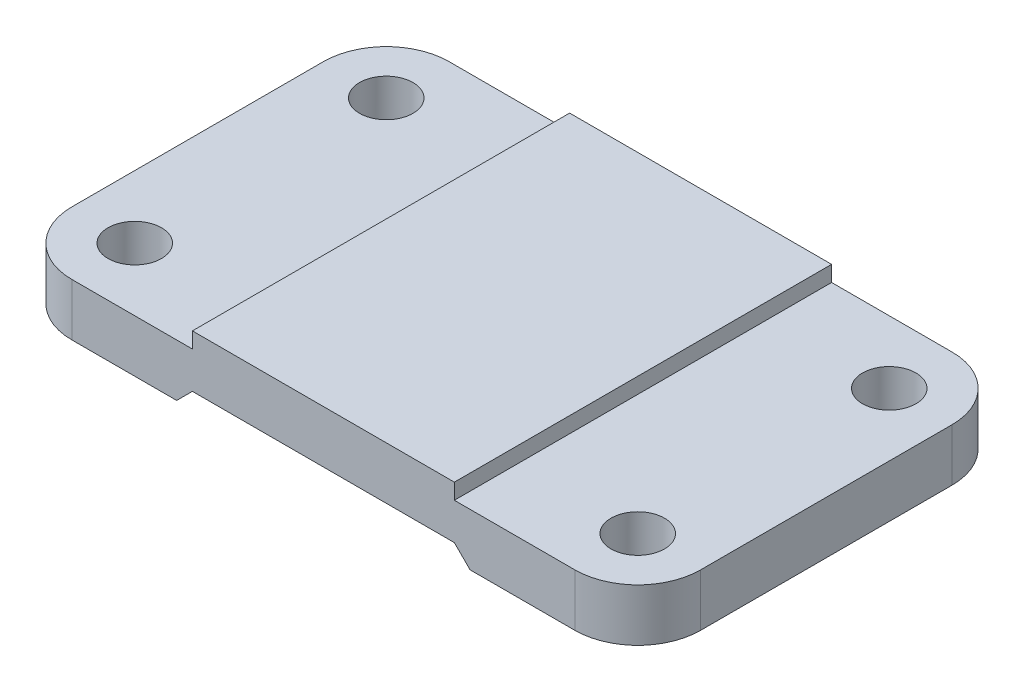
ISO-10303-21;
HEADER;
FILE_DESCRIPTION(('STEP AP214'),'2;1');
FILE_NAME('part.step','',(''),(''),'','','');
FILE_SCHEMA(('AUTOMOTIVE_DESIGN { 1 0 10303 214 1 1 1 1 }'));
ENDSEC;
DATA;
#1=APPLICATION_CONTEXT('core data for automotive mechanical design processes');
#2=APPLICATION_PROTOCOL_DEFINITION('international standard','automotive_design',2000,#1);
#3=PRODUCT_CONTEXT('',#1,'mechanical');
#4=PRODUCT('Part','Part','',(#3));
#5=PRODUCT_RELATED_PRODUCT_CATEGORY('part','',(#4));
#6=PRODUCT_DEFINITION_FORMATION('','',#4);
#7=PRODUCT_DEFINITION_CONTEXT('part definition',#1,'design');
#8=PRODUCT_DEFINITION('design','',#6,#7);
#9=PRODUCT_DEFINITION_SHAPE('','',#8);
#10=(LENGTH_UNIT() NAMED_UNIT(*) SI_UNIT(.MILLI.,.METRE.));
#11=(NAMED_UNIT(*) PLANE_ANGLE_UNIT() SI_UNIT($,.RADIAN.));
#12=(NAMED_UNIT(*) SI_UNIT($,.STERADIAN.) SOLID_ANGLE_UNIT());
#13=UNCERTAINTY_MEASURE_WITH_UNIT(LENGTH_MEASURE(1.E-05),#10,'distance_accuracy_value','');
#14=(GEOMETRIC_REPRESENTATION_CONTEXT(3) GLOBAL_UNCERTAINTY_ASSIGNED_CONTEXT((#13)) GLOBAL_UNIT_ASSIGNED_CONTEXT((#10,
#11,#12)) REPRESENTATION_CONTEXT('',''));
#15=CARTESIAN_POINT('',(0.,0.,0.));
#16=DIRECTION('',(0.,0.,1.));
#17=DIRECTION('',(1.,0.,0.));
#18=AXIS2_PLACEMENT_3D('',#15,#16,#17);
#19=CARTESIAN_POINT('',(0.,0.,0.));
#20=DIRECTION('',(0.,-1.,0.));
#21=DIRECTION('',(0.,0.,-1.));
#22=AXIS2_PLACEMENT_3D('',#19,#20,#21);
#23=PLANE('',#22);
#24=DIRECTION('',(0.,0.,1.));
#25=VECTOR('',#24,1.);
#26=CARTESIAN_POINT('',(-28.,0.,-36.));
#27=LINE('',#26,#25);
#28=CARTESIAN_POINT('',(-28.,0.,-36.));
#29=VERTEX_POINT('',#28);
#30=CARTESIAN_POINT('',(-28.,0.,36.));
#31=VERTEX_POINT('',#30);
#32=EDGE_CURVE('E179',#29,#31,#27,.T.);
#33=ORIENTED_EDGE('',*,*,#32,.T.);
#34=DIRECTION('',(1.,0.,0.));
#35=VECTOR('',#34,1.);
#36=CARTESIAN_POINT('',(-60.,0.,36.));
#37=LINE('',#36,#35);
#38=CARTESIAN_POINT('',(-48.,0.,36.));
#39=VERTEX_POINT('',#38);
#40=EDGE_CURVE('E238',#39,#31,#37,.T.);
#41=ORIENTED_EDGE('',*,*,#40,.F.);
#42=CARTESIAN_POINT('',(-48.,0.,24.));
#43=DIRECTION('',(0.,-1.,0.));
#44=DIRECTION('',(0.,0.,-1.));
#45=AXIS2_PLACEMENT_3D('',#42,#43,#44);
#46=CIRCLE('',#45,12.);
#47=CARTESIAN_POINT('',(-60.,0.,24.));
#48=VERTEX_POINT('',#47);
#49=EDGE_CURVE('E267',#39,#48,#46,.T.);
#50=ORIENTED_EDGE('',*,*,#49,.T.);
#51=DIRECTION('',(0.,0.,1.));
#52=VECTOR('',#51,1.);
#53=CARTESIAN_POINT('',(-60.,0.,36.));
#54=LINE('',#53,#52);
#55=CARTESIAN_POINT('',(-60.,0.,-24.));
#56=VERTEX_POINT('',#55);
#57=EDGE_CURVE('E252',#56,#48,#54,.T.);
#58=ORIENTED_EDGE('',*,*,#57,.F.);
#59=CARTESIAN_POINT('',(-48.,0.,-24.));
#60=DIRECTION('',(0.,-1.,0.));
#61=DIRECTION('',(0.,0.,-1.));
#62=AXIS2_PLACEMENT_3D('',#59,#60,#61);
#63=CIRCLE('',#62,12.);
#64=CARTESIAN_POINT('',(-48.,0.,-36.));
#65=VERTEX_POINT('',#64);
#66=EDGE_CURVE('E269',#56,#65,#63,.T.);
#67=ORIENTED_EDGE('',*,*,#66,.T.);
#68=DIRECTION('',(-1.,0.,0.));
#69=VECTOR('',#68,1.);
#70=CARTESIAN_POINT('',(-60.,0.,-36.));
#71=LINE('',#70,#69);
#72=EDGE_CURVE('E250',#29,#65,#71,.T.);
#73=ORIENTED_EDGE('',*,*,#72,.F.);
#74=EDGE_LOOP('',(#33,#41,#50,#58,#67,#73));
#75=FACE_BOUND('',#74,.T.);
#76=CARTESIAN_POINT('',(-48.,0.,24.));
#77=DIRECTION('',(0.,-1.,0.));
#78=DIRECTION('',(0.,0.,-1.));
#79=AXIS2_PLACEMENT_3D('',#76,#77,#78);
#80=CIRCLE('',#79,5.09999999999999);
#81=CARTESIAN_POINT('',(-48.,0.,18.9));
#82=VERTEX_POINT('',#81);
#83=EDGE_CURVE('E230',#82,#82,#80,.T.);
#84=ORIENTED_EDGE('',*,*,#83,.F.);
#85=EDGE_LOOP('',(#84));
#86=FACE_BOUND('',#85,.T.);
#87=CARTESIAN_POINT('',(-48.,0.,-24.));
#88=DIRECTION('',(0.,-1.,0.));
#89=DIRECTION('',(0.,0.,-1.));
#90=AXIS2_PLACEMENT_3D('',#87,#88,#89);
#91=CIRCLE('',#90,5.09999999999999);
#92=CARTESIAN_POINT('',(-48.,0.,-29.1));
#93=VERTEX_POINT('',#92);
#94=EDGE_CURVE('E224',#93,#93,#91,.T.);
#95=ORIENTED_EDGE('',*,*,#94,.F.);
#96=EDGE_LOOP('',(#95));
#97=FACE_BOUND('',#96,.T.);
#98=ADVANCED_FACE('F37',(#75,#86,#97),#23,.T.);
#99=CARTESIAN_POINT('',(0.,10.,0.));
#100=DIRECTION('',(0.,-1.,0.));
#101=DIRECTION('',(0.,0.,-1.));
#102=AXIS2_PLACEMENT_3D('',#99,#100,#101);
#103=PLANE('',#102);
#104=CARTESIAN_POINT('',(-48.,10.,-24.));
#105=DIRECTION('',(0.,1.,0.));
#106=DIRECTION('',(0.,0.,1.));
#107=AXIS2_PLACEMENT_3D('',#104,#105,#106);
#108=CIRCLE('',#107,5.09999999999999);
#109=CARTESIAN_POINT('',(-48.,10.,-18.9));
#110=VERTEX_POINT('',#109);
#111=EDGE_CURVE('E221',#110,#110,#108,.T.);
#112=ORIENTED_EDGE('',*,*,#111,.F.);
#113=EDGE_LOOP('',(#112));
#114=FACE_BOUND('',#113,.T.);
#115=CARTESIAN_POINT('',(-48.,10.,24.));
#116=DIRECTION('',(0.,1.,0.));
#117=DIRECTION('',(0.,0.,1.));
#118=AXIS2_PLACEMENT_3D('',#115,#116,#117);
#119=CIRCLE('',#118,5.09999999999999);
#120=CARTESIAN_POINT('',(-48.,10.,29.1));
#121=VERTEX_POINT('',#120);
#122=EDGE_CURVE('E227',#121,#121,#119,.T.);
#123=ORIENTED_EDGE('',*,*,#122,.F.);
#124=EDGE_LOOP('',(#123));
#125=FACE_BOUND('',#124,.T.);
#126=DIRECTION('',(0.,0.,1.));
#127=VECTOR('',#126,1.);
#128=CARTESIAN_POINT('',(-25.,10.,36.));
#129=LINE('',#128,#127);
#130=CARTESIAN_POINT('',(-25.,10.,-36.));
#131=VERTEX_POINT('',#130);
#132=CARTESIAN_POINT('',(-25.,10.,36.));
#133=VERTEX_POINT('',#132);
#134=EDGE_CURVE('E182',#131,#133,#129,.T.);
#135=ORIENTED_EDGE('',*,*,#134,.F.);
#136=DIRECTION('',(-1.,0.,0.));
#137=VECTOR('',#136,1.);
#138=CARTESIAN_POINT('',(-60.,10.,-36.));
#139=LINE('',#138,#137);
#140=CARTESIAN_POINT('',(-48.,10.,-36.));
#141=VERTEX_POINT('',#140);
#142=EDGE_CURVE('E237',#131,#141,#139,.T.);
#143=ORIENTED_EDGE('',*,*,#142,.T.);
#144=CARTESIAN_POINT('',(-48.,10.,-24.));
#145=DIRECTION('',(0.,-1.,0.));
#146=DIRECTION('',(0.,0.,-1.));
#147=AXIS2_PLACEMENT_3D('',#144,#145,#146);
#148=CIRCLE('',#147,12.);
#149=CARTESIAN_POINT('',(-60.,10.,-24.));
#150=VERTEX_POINT('',#149);
#151=EDGE_CURVE('E283',#141,#150,#148,.F.);
#152=ORIENTED_EDGE('',*,*,#151,.T.);
#153=DIRECTION('',(0.,0.,1.));
#154=VECTOR('',#153,1.);
#155=CARTESIAN_POINT('',(-60.,10.,36.));
#156=LINE('',#155,#154);
#157=CARTESIAN_POINT('',(-60.,10.,24.));
#158=VERTEX_POINT('',#157);
#159=EDGE_CURVE('E241',#150,#158,#156,.T.);
#160=ORIENTED_EDGE('',*,*,#159,.T.);
#161=CARTESIAN_POINT('',(-48.,10.,24.));
#162=DIRECTION('',(0.,-1.,0.));
#163=DIRECTION('',(0.,0.,-1.));
#164=AXIS2_PLACEMENT_3D('',#161,#162,#163);
#165=CIRCLE('',#164,12.);
#166=CARTESIAN_POINT('',(-48.,10.,36.));
#167=VERTEX_POINT('',#166);
#168=EDGE_CURVE('E281',#158,#167,#165,.F.);
#169=ORIENTED_EDGE('',*,*,#168,.T.);
#170=DIRECTION('',(1.,0.,0.));
#171=VECTOR('',#170,1.);
#172=CARTESIAN_POINT('',(-60.,10.,36.));
#173=LINE('',#172,#171);
#174=EDGE_CURVE('E245',#167,#133,#173,.T.);
#175=ORIENTED_EDGE('',*,*,#174,.T.);
#176=EDGE_LOOP('',(#135,#143,#152,#160,#169,#175));
#177=FACE_BOUND('',#176,.T.);
#178=ADVANCED_FACE('F329',(#114,#125,#177),#103,.F.);
#179=CARTESIAN_POINT('',(48.,10.,24.));
#180=DIRECTION('',(0.,1.,0.));
#181=DIRECTION('',(0.,0.,1.));
#182=AXIS2_PLACEMENT_3D('',#179,#180,#181);
#183=CIRCLE('',#182,5.09999999999999);
#184=CARTESIAN_POINT('',(48.,10.,29.1));
#185=VERTEX_POINT('',#184);
#186=EDGE_CURVE('E209',#185,#185,#183,.T.);
#187=ORIENTED_EDGE('',*,*,#186,.F.);
#188=EDGE_LOOP('',(#187));
#189=FACE_BOUND('',#188,.T.);
#190=CARTESIAN_POINT('',(48.,10.,-24.));
#191=DIRECTION('',(0.,1.,0.));
#192=DIRECTION('',(0.,0.,1.));
#193=AXIS2_PLACEMENT_3D('',#190,#191,#192);
#194=CIRCLE('',#193,5.09999999999999);
#195=CARTESIAN_POINT('',(48.,10.,-18.9));
#196=VERTEX_POINT('',#195);
#197=EDGE_CURVE('E215',#196,#196,#194,.T.);
#198=ORIENTED_EDGE('',*,*,#197,.F.);
#199=EDGE_LOOP('',(#198));
#200=FACE_BOUND('',#199,.T.);
#201=DIRECTION('',(0.,0.,-1.));
#202=VECTOR('',#201,1.);
#203=CARTESIAN_POINT('',(25.,10.,36.));
#204=LINE('',#203,#202);
#205=CARTESIAN_POINT('',(25.,10.,36.));
#206=VERTEX_POINT('',#205);
#207=CARTESIAN_POINT('',(25.,10.,-36.));
#208=VERTEX_POINT('',#207);
#209=EDGE_CURVE('E60',#206,#208,#204,.T.);
#210=ORIENTED_EDGE('',*,*,#209,.F.);
#211=CARTESIAN_POINT('',(48.,10.,36.));
#212=VERTEX_POINT('',#211);
#213=EDGE_CURVE('E244',#206,#212,#173,.T.);
#214=ORIENTED_EDGE('',*,*,#213,.T.);
#215=CARTESIAN_POINT('',(48.,10.,24.));
#216=DIRECTION('',(0.,-1.,0.));
#217=DIRECTION('',(0.,0.,-1.));
#218=AXIS2_PLACEMENT_3D('',#215,#216,#217);
#219=CIRCLE('',#218,12.);
#220=CARTESIAN_POINT('',(60.,10.,24.));
#221=VERTEX_POINT('',#220);
#222=EDGE_CURVE('E277',#212,#221,#219,.F.);
#223=ORIENTED_EDGE('',*,*,#222,.T.);
#224=DIRECTION('',(0.,0.,-1.));
#225=VECTOR('',#224,1.);
#226=CARTESIAN_POINT('',(60.,10.,36.));
#227=LINE('',#226,#225);
#228=CARTESIAN_POINT('',(60.,10.,-24.));
#229=VERTEX_POINT('',#228);
#230=EDGE_CURVE('E234',#221,#229,#227,.T.);
#231=ORIENTED_EDGE('',*,*,#230,.T.);
#232=CARTESIAN_POINT('',(48.,10.,-24.));
#233=DIRECTION('',(0.,-1.,0.));
#234=DIRECTION('',(0.,0.,-1.));
#235=AXIS2_PLACEMENT_3D('',#232,#233,#234);
#236=CIRCLE('',#235,12.);
#237=CARTESIAN_POINT('',(48.,10.,-36.));
#238=VERTEX_POINT('',#237);
#239=EDGE_CURVE('E279',#229,#238,#236,.F.);
#240=ORIENTED_EDGE('',*,*,#239,.T.);
#241=EDGE_CURVE('E239',#238,#208,#139,.T.);
#242=ORIENTED_EDGE('',*,*,#241,.T.);
#243=EDGE_LOOP('',(#210,#214,#223,#231,#240,#242));
#244=FACE_BOUND('',#243,.T.);
#245=ADVANCED_FACE('F311',(#189,#200,#244),#103,.F.);
#246=CARTESIAN_POINT('',(60.,10.,36.));
#247=DIRECTION('',(-1.,0.,0.));
#248=DIRECTION('',(0.,0.,1.));
#249=AXIS2_PLACEMENT_3D('',#246,#247,#248);
#250=PLANE('',#249);
#251=DIRECTION('',(0.,0.,-1.));
#252=VECTOR('',#251,1.);
#253=CARTESIAN_POINT('',(60.,0.,36.));
#254=LINE('',#253,#252);
#255=CARTESIAN_POINT('',(60.,0.,24.));
#256=VERTEX_POINT('',#255);
#257=CARTESIAN_POINT('',(60.,0.,-24.));
#258=VERTEX_POINT('',#257);
#259=EDGE_CURVE('E233',#256,#258,#254,.T.);
#260=ORIENTED_EDGE('',*,*,#259,.T.);
#261=DIRECTION('',(0.,-1.,0.));
#262=VECTOR('',#261,1.);
#263=CARTESIAN_POINT('',(60.,10.,-24.));
#264=LINE('',#263,#262);
#265=EDGE_CURVE('E11',#258,#229,#264,.F.);
#266=ORIENTED_EDGE('',*,*,#265,.T.);
#267=ORIENTED_EDGE('',*,*,#230,.F.);
#268=DIRECTION('',(0.,-1.,0.));
#269=VECTOR('',#268,1.);
#270=CARTESIAN_POINT('',(60.,10.,24.));
#271=LINE('',#270,#269);
#272=EDGE_CURVE('E45',#221,#256,#271,.T.);
#273=ORIENTED_EDGE('',*,*,#272,.T.);
#274=EDGE_LOOP('',(#260,#266,#267,#273));
#275=FACE_BOUND('',#274,.T.);
#276=ADVANCED_FACE('F295',(#275),#250,.F.);
#277=CARTESIAN_POINT('',(-60.,10.,-36.));
#278=DIRECTION('',(0.,0.,1.));
#279=DIRECTION('',(1.,0.,0.));
#280=AXIS2_PLACEMENT_3D('',#277,#278,#279);
#281=PLANE('',#280);
#282=DIRECTION('',(-1.,0.,0.));
#283=VECTOR('',#282,1.);
#284=CARTESIAN_POINT('',(-25.,2.99999999999999,-36.));
#285=LINE('',#284,#283);
#286=CARTESIAN_POINT('',(25.,2.99999999999999,-36.));
#287=VERTEX_POINT('',#286);
#288=CARTESIAN_POINT('',(-25.,2.99999999999999,-36.));
#289=VERTEX_POINT('',#288);
#290=EDGE_CURVE('E159',#287,#289,#285,.T.);
#291=ORIENTED_EDGE('',*,*,#290,.T.);
#292=DIRECTION('',(-0.707106781186551,-0.707106781186544,0.));
#293=VECTOR('',#292,1.);
#294=CARTESIAN_POINT('',(-28.,0.,-36.));
#295=LINE('',#294,#293);
#296=EDGE_CURVE('E164',#289,#29,#295,.T.);
#297=ORIENTED_EDGE('',*,*,#296,.T.);
#298=ORIENTED_EDGE('',*,*,#72,.T.);
#299=DIRECTION('',(0.,-1.,0.));
#300=VECTOR('',#299,1.);
#301=CARTESIAN_POINT('',(-48.,10.,-36.));
#302=LINE('',#301,#300);
#303=EDGE_CURVE('E274',#65,#141,#302,.F.);
#304=ORIENTED_EDGE('',*,*,#303,.T.);
#305=ORIENTED_EDGE('',*,*,#142,.F.);
#306=DIRECTION('',(0.,-1.,0.));
#307=VECTOR('',#306,1.);
#308=CARTESIAN_POINT('',(-25.,13.,-36.));
#309=LINE('',#308,#307);
#310=CARTESIAN_POINT('',(-25.,13.,-36.));
#311=VERTEX_POINT('',#310);
#312=EDGE_CURVE('E194',#311,#131,#309,.T.);
#313=ORIENTED_EDGE('',*,*,#312,.F.);
#314=DIRECTION('',(-1.,0.,0.));
#315=VECTOR('',#314,1.);
#316=CARTESIAN_POINT('',(25.,13.,-36.));
#317=LINE('',#316,#315);
#318=CARTESIAN_POINT('',(25.,13.,-36.));
#319=VERTEX_POINT('',#318);
#320=EDGE_CURVE('E192',#319,#311,#317,.T.);
#321=ORIENTED_EDGE('',*,*,#320,.F.);
#322=DIRECTION('',(0.,-1.,0.));
#323=VECTOR('',#322,1.);
#324=CARTESIAN_POINT('',(25.,13.,-36.));
#325=LINE('',#324,#323);
#326=EDGE_CURVE('E200',#319,#208,#325,.T.);
#327=ORIENTED_EDGE('',*,*,#326,.T.);
#328=ORIENTED_EDGE('',*,*,#241,.F.);
#329=DIRECTION('',(0.,-1.,0.));
#330=VECTOR('',#329,1.);
#331=CARTESIAN_POINT('',(48.,10.,-36.));
#332=LINE('',#331,#330);
#333=CARTESIAN_POINT('',(48.,0.,-36.));
#334=VERTEX_POINT('',#333);
#335=EDGE_CURVE('E272',#238,#334,#332,.T.);
#336=ORIENTED_EDGE('',*,*,#335,.T.);
#337=CARTESIAN_POINT('',(28.,0.,-36.));
#338=VERTEX_POINT('',#337);
#339=EDGE_CURVE('E170',#334,#338,#71,.T.);
#340=ORIENTED_EDGE('',*,*,#339,.T.);
#341=DIRECTION('',(-0.707106781186544,0.707106781186551,0.));
#342=VECTOR('',#341,1.);
#343=CARTESIAN_POINT('',(25.,2.99999999999999,-36.));
#344=LINE('',#343,#342);
#345=EDGE_CURVE('E52',#338,#287,#344,.T.);
#346=ORIENTED_EDGE('',*,*,#345,.T.);
#347=EDGE_LOOP('',(#291,#297,#298,#304,#305,#313,#321,#327,#328,#336,#340,#346));
#348=FACE_BOUND('',#347,.T.);
#349=ADVANCED_FACE('F167',(#348),#281,.F.);
#350=CARTESIAN_POINT('',(-60.,10.,36.));
#351=DIRECTION('',(1.,0.,0.));
#352=DIRECTION('',(0.,0.,-1.));
#353=AXIS2_PLACEMENT_3D('',#350,#351,#352);
#354=PLANE('',#353);
#355=ORIENTED_EDGE('',*,*,#159,.F.);
#356=DIRECTION('',(0.,-1.,0.));
#357=VECTOR('',#356,1.);
#358=CARTESIAN_POINT('',(-60.,10.,-24.));
#359=LINE('',#358,#357);
#360=EDGE_CURVE('E259',#150,#56,#359,.T.);
#361=ORIENTED_EDGE('',*,*,#360,.T.);
#362=ORIENTED_EDGE('',*,*,#57,.T.);
#363=DIRECTION('',(0.,-1.,0.));
#364=VECTOR('',#363,1.);
#365=CARTESIAN_POINT('',(-60.,10.,24.));
#366=LINE('',#365,#364);
#367=EDGE_CURVE('E247',#48,#158,#366,.F.);
#368=ORIENTED_EDGE('',*,*,#367,.T.);
#369=EDGE_LOOP('',(#355,#361,#362,#368));
#370=FACE_BOUND('',#369,.T.);
#371=ADVANCED_FACE('F347',(#370),#354,.F.);
#372=CARTESIAN_POINT('',(-60.,10.,36.));
#373=DIRECTION('',(0.,0.,-1.));
#374=DIRECTION('',(-1.,0.,0.));
#375=AXIS2_PLACEMENT_3D('',#372,#373,#374);
#376=PLANE('',#375);
#377=ORIENTED_EDGE('',*,*,#40,.T.);
#378=DIRECTION('',(-0.707106781186551,-0.707106781186544,0.));
#379=VECTOR('',#378,1.);
#380=CARTESIAN_POINT('',(-28.,0.,36.));
#381=LINE('',#380,#379);
#382=CARTESIAN_POINT('',(-25.,2.99999999999999,36.));
#383=VERTEX_POINT('',#382);
#384=EDGE_CURVE('E171',#383,#31,#381,.T.);
#385=ORIENTED_EDGE('',*,*,#384,.F.);
#386=DIRECTION('',(-1.,0.,0.));
#387=VECTOR('',#386,1.);
#388=CARTESIAN_POINT('',(-25.,2.99999999999999,36.));
#389=LINE('',#388,#387);
#390=CARTESIAN_POINT('',(25.,2.99999999999999,36.));
#391=VERTEX_POINT('',#390);
#392=EDGE_CURVE('E173',#391,#383,#389,.T.);
#393=ORIENTED_EDGE('',*,*,#392,.F.);
#394=DIRECTION('',(-0.707106781186544,0.707106781186551,0.));
#395=VECTOR('',#394,1.);
#396=CARTESIAN_POINT('',(25.,2.99999999999999,36.));
#397=LINE('',#396,#395);
#398=CARTESIAN_POINT('',(28.,0.,36.));
#399=VERTEX_POINT('',#398);
#400=EDGE_CURVE('E151',#399,#391,#397,.T.);
#401=ORIENTED_EDGE('',*,*,#400,.F.);
#402=CARTESIAN_POINT('',(48.,0.,36.));
#403=VERTEX_POINT('',#402);
#404=EDGE_CURVE('E255',#399,#403,#37,.T.);
#405=ORIENTED_EDGE('',*,*,#404,.T.);
#406=DIRECTION('',(0.,-1.,0.));
#407=VECTOR('',#406,1.);
#408=CARTESIAN_POINT('',(48.,10.,36.));
#409=LINE('',#408,#407);
#410=EDGE_CURVE('E285',#403,#212,#409,.F.);
#411=ORIENTED_EDGE('',*,*,#410,.T.);
#412=ORIENTED_EDGE('',*,*,#213,.F.);
#413=DIRECTION('',(0.,-1.,0.));
#414=VECTOR('',#413,1.);
#415=CARTESIAN_POINT('',(25.,13.,36.));
#416=LINE('',#415,#414);
#417=CARTESIAN_POINT('',(25.,13.,36.));
#418=VERTEX_POINT('',#417);
#419=EDGE_CURVE('E203',#418,#206,#416,.T.);
#420=ORIENTED_EDGE('',*,*,#419,.F.);
#421=DIRECTION('',(1.,0.,0.));
#422=VECTOR('',#421,1.);
#423=CARTESIAN_POINT('',(25.,13.,36.));
#424=LINE('',#423,#422);
#425=CARTESIAN_POINT('',(-25.,13.,36.));
#426=VERTEX_POINT('',#425);
#427=EDGE_CURVE('E188',#426,#418,#424,.T.);
#428=ORIENTED_EDGE('',*,*,#427,.F.);
#429=DIRECTION('',(0.,-1.,0.));
#430=VECTOR('',#429,1.);
#431=CARTESIAN_POINT('',(-25.,13.,36.));
#432=LINE('',#431,#430);
#433=EDGE_CURVE('E206',#426,#133,#432,.T.);
#434=ORIENTED_EDGE('',*,*,#433,.T.);
#435=ORIENTED_EDGE('',*,*,#174,.F.);
#436=DIRECTION('',(0.,-1.,0.));
#437=VECTOR('',#436,1.);
#438=CARTESIAN_POINT('',(-48.,10.,36.));
#439=LINE('',#438,#437);
#440=EDGE_CURVE('E288',#167,#39,#439,.T.);
#441=ORIENTED_EDGE('',*,*,#440,.T.);
#442=EDGE_LOOP('',(#377,#385,#393,#401,#405,#411,#412,#420,#428,#434,#435,#441));
#443=FACE_BOUND('',#442,.T.);
#444=ADVANCED_FACE('F317',(#443),#376,.F.);
#445=DIRECTION('',(0.,0.,1.));
#446=VECTOR('',#445,1.);
#447=CARTESIAN_POINT('',(28.,0.,-36.));
#448=LINE('',#447,#446);
#449=EDGE_CURVE('E156',#338,#399,#448,.T.);
#450=ORIENTED_EDGE('',*,*,#449,.F.);
#451=ORIENTED_EDGE('',*,*,#339,.F.);
#452=CARTESIAN_POINT('',(48.,0.,-24.));
#453=DIRECTION('',(0.,-1.,0.));
#454=DIRECTION('',(0.,0.,-1.));
#455=AXIS2_PLACEMENT_3D('',#452,#453,#454);
#456=CIRCLE('',#455,12.);
#457=EDGE_CURVE('E265',#334,#258,#456,.T.);
#458=ORIENTED_EDGE('',*,*,#457,.T.);
#459=ORIENTED_EDGE('',*,*,#259,.F.);
#460=CARTESIAN_POINT('',(48.,0.,24.));
#461=DIRECTION('',(0.,-1.,0.));
#462=DIRECTION('',(0.,0.,-1.));
#463=AXIS2_PLACEMENT_3D('',#460,#461,#462);
#464=CIRCLE('',#463,12.);
#465=EDGE_CURVE('E262',#256,#403,#464,.T.);
#466=ORIENTED_EDGE('',*,*,#465,.T.);
#467=ORIENTED_EDGE('',*,*,#404,.F.);
#468=EDGE_LOOP('',(#450,#451,#458,#459,#466,#467));
#469=FACE_BOUND('',#468,.T.);
#470=CARTESIAN_POINT('',(48.,0.,24.));
#471=DIRECTION('',(0.,-1.,0.));
#472=DIRECTION('',(0.,0.,-1.));
#473=AXIS2_PLACEMENT_3D('',#470,#471,#472);
#474=CIRCLE('',#473,5.09999999999999);
#475=CARTESIAN_POINT('',(48.,0.,18.9));
#476=VERTEX_POINT('',#475);
#477=EDGE_CURVE('E212',#476,#476,#474,.T.);
#478=ORIENTED_EDGE('',*,*,#477,.F.);
#479=EDGE_LOOP('',(#478));
#480=FACE_BOUND('',#479,.T.);
#481=CARTESIAN_POINT('',(48.,0.,-24.));
#482=DIRECTION('',(0.,-1.,0.));
#483=DIRECTION('',(0.,0.,-1.));
#484=AXIS2_PLACEMENT_3D('',#481,#482,#483);
#485=CIRCLE('',#484,5.09999999999999);
#486=CARTESIAN_POINT('',(48.,0.,-29.1));
#487=VERTEX_POINT('',#486);
#488=EDGE_CURVE('E218',#487,#487,#485,.T.);
#489=ORIENTED_EDGE('',*,*,#488,.F.);
#490=EDGE_LOOP('',(#489));
#491=FACE_BOUND('',#490,.T.);
#492=ADVANCED_FACE('F300',(#469,#480,#491),#23,.T.);
#493=CARTESIAN_POINT('',(-48.,10.,-24.));
#494=DIRECTION('',(0.,-1.,0.));
#495=DIRECTION('',(0.,0.,-1.));
#496=AXIS2_PLACEMENT_3D('',#493,#494,#495);
#497=CYLINDRICAL_SURFACE('',#496,12.);
#498=ORIENTED_EDGE('',*,*,#151,.F.);
#499=ORIENTED_EDGE('',*,*,#303,.F.);
#500=ORIENTED_EDGE('',*,*,#66,.F.);
#501=ORIENTED_EDGE('',*,*,#360,.F.);
#502=EDGE_LOOP('',(#498,#499,#500,#501));
#503=FACE_BOUND('',#502,.T.);
#504=ADVANCED_FACE('F340',(#503),#497,.T.);
#505=CARTESIAN_POINT('',(-48.,10.,24.));
#506=DIRECTION('',(0.,-1.,0.));
#507=DIRECTION('',(0.,0.,-1.));
#508=AXIS2_PLACEMENT_3D('',#505,#506,#507);
#509=CYLINDRICAL_SURFACE('',#508,12.);
#510=ORIENTED_EDGE('',*,*,#168,.F.);
#511=ORIENTED_EDGE('',*,*,#367,.F.);
#512=ORIENTED_EDGE('',*,*,#49,.F.);
#513=ORIENTED_EDGE('',*,*,#440,.F.);
#514=EDGE_LOOP('',(#510,#511,#512,#513));
#515=FACE_BOUND('',#514,.T.);
#516=ADVANCED_FACE('F327',(#515),#509,.T.);
#517=CARTESIAN_POINT('',(48.,10.,-24.));
#518=DIRECTION('',(0.,-1.,0.));
#519=DIRECTION('',(0.,0.,-1.));
#520=AXIS2_PLACEMENT_3D('',#517,#518,#519);
#521=CYLINDRICAL_SURFACE('',#520,12.);
#522=ORIENTED_EDGE('',*,*,#239,.F.);
#523=ORIENTED_EDGE('',*,*,#265,.F.);
#524=ORIENTED_EDGE('',*,*,#457,.F.);
#525=ORIENTED_EDGE('',*,*,#335,.F.);
#526=EDGE_LOOP('',(#522,#523,#524,#525));
#527=FACE_BOUND('',#526,.T.);
#528=ADVANCED_FACE('F307',(#527),#521,.T.);
#529=CARTESIAN_POINT('',(48.,10.,24.));
#530=DIRECTION('',(0.,-1.,0.));
#531=DIRECTION('',(0.,0.,-1.));
#532=AXIS2_PLACEMENT_3D('',#529,#530,#531);
#533=CYLINDRICAL_SURFACE('',#532,12.);
#534=ORIENTED_EDGE('',*,*,#222,.F.);
#535=ORIENTED_EDGE('',*,*,#410,.F.);
#536=ORIENTED_EDGE('',*,*,#465,.F.);
#537=ORIENTED_EDGE('',*,*,#272,.F.);
#538=EDGE_LOOP('',(#534,#535,#536,#537));
#539=FACE_BOUND('',#538,.T.);
#540=ADVANCED_FACE('F39',(#539),#533,.T.);
#541=CARTESIAN_POINT('',(-48.,10.,24.));
#542=DIRECTION('',(0.,1.,0.));
#543=DIRECTION('',(0.,0.,1.));
#544=AXIS2_PLACEMENT_3D('',#541,#542,#543);
#545=CYLINDRICAL_SURFACE('',#544,5.09999999999999);
#546=ORIENTED_EDGE('',*,*,#122,.T.);
#547=EDGE_LOOP('',(#546));
#548=FACE_BOUND('',#547,.T.);
#549=ORIENTED_EDGE('',*,*,#83,.T.);
#550=EDGE_LOOP('',(#549));
#551=FACE_BOUND('',#550,.T.);
#552=ADVANCED_FACE('F319',(#548,#551),#545,.F.);
#553=CARTESIAN_POINT('',(-48.,10.,-24.));
#554=DIRECTION('',(0.,1.,0.));
#555=DIRECTION('',(0.,0.,1.));
#556=AXIS2_PLACEMENT_3D('',#553,#554,#555);
#557=CYLINDRICAL_SURFACE('',#556,5.09999999999999);
#558=ORIENTED_EDGE('',*,*,#111,.T.);
#559=EDGE_LOOP('',(#558));
#560=FACE_BOUND('',#559,.T.);
#561=ORIENTED_EDGE('',*,*,#94,.T.);
#562=EDGE_LOOP('',(#561));
#563=FACE_BOUND('',#562,.T.);
#564=ADVANCED_FACE('F324',(#560,#563),#557,.F.);
#565=CARTESIAN_POINT('',(48.,10.,-24.));
#566=DIRECTION('',(0.,1.,0.));
#567=DIRECTION('',(0.,0.,1.));
#568=AXIS2_PLACEMENT_3D('',#565,#566,#567);
#569=CYLINDRICAL_SURFACE('',#568,5.09999999999999);
#570=ORIENTED_EDGE('',*,*,#197,.T.);
#571=EDGE_LOOP('',(#570));
#572=FACE_BOUND('',#571,.T.);
#573=ORIENTED_EDGE('',*,*,#488,.T.);
#574=EDGE_LOOP('',(#573));
#575=FACE_BOUND('',#574,.T.);
#576=ADVANCED_FACE('F403',(#572,#575),#569,.F.);
#577=CARTESIAN_POINT('',(48.,10.,24.));
#578=DIRECTION('',(0.,1.,0.));
#579=DIRECTION('',(0.,0.,1.));
#580=AXIS2_PLACEMENT_3D('',#577,#578,#579);
#581=CYLINDRICAL_SURFACE('',#580,5.09999999999999);
#582=ORIENTED_EDGE('',*,*,#186,.T.);
#583=EDGE_LOOP('',(#582));
#584=FACE_BOUND('',#583,.T.);
#585=ORIENTED_EDGE('',*,*,#477,.T.);
#586=EDGE_LOOP('',(#585));
#587=FACE_BOUND('',#586,.T.);
#588=ADVANCED_FACE('F400',(#584,#587),#581,.F.);
#589=CARTESIAN_POINT('',(-25.,13.,36.));
#590=DIRECTION('',(1.,0.,0.));
#591=DIRECTION('',(0.,0.,-1.));
#592=AXIS2_PLACEMENT_3D('',#589,#590,#591);
#593=PLANE('',#592);
#594=ORIENTED_EDGE('',*,*,#134,.T.);
#595=ORIENTED_EDGE('',*,*,#433,.F.);
#596=DIRECTION('',(0.,0.,1.));
#597=VECTOR('',#596,1.);
#598=CARTESIAN_POINT('',(-25.,13.,36.));
#599=LINE('',#598,#597);
#600=EDGE_CURVE('E185',#311,#426,#599,.T.);
#601=ORIENTED_EDGE('',*,*,#600,.F.);
#602=ORIENTED_EDGE('',*,*,#312,.T.);
#603=EDGE_LOOP('',(#594,#595,#601,#602));
#604=FACE_BOUND('',#603,.T.);
#605=ADVANCED_FACE('F372',(#604),#593,.F.);
#606=CARTESIAN_POINT('',(25.,13.,36.));
#607=DIRECTION('',(-1.,0.,0.));
#608=DIRECTION('',(0.,0.,1.));
#609=AXIS2_PLACEMENT_3D('',#606,#607,#608);
#610=PLANE('',#609);
#611=ORIENTED_EDGE('',*,*,#209,.T.);
#612=ORIENTED_EDGE('',*,*,#326,.F.);
#613=DIRECTION('',(0.,0.,-1.));
#614=VECTOR('',#613,1.);
#615=CARTESIAN_POINT('',(25.,13.,36.));
#616=LINE('',#615,#614);
#617=EDGE_CURVE('E190',#418,#319,#616,.T.);
#618=ORIENTED_EDGE('',*,*,#617,.F.);
#619=ORIENTED_EDGE('',*,*,#419,.T.);
#620=EDGE_LOOP('',(#611,#612,#618,#619));
#621=FACE_BOUND('',#620,.T.);
#622=ADVANCED_FACE('F313',(#621),#610,.F.);
#623=CARTESIAN_POINT('',(0.,13.,0.));
#624=DIRECTION('',(0.,1.,0.));
#625=DIRECTION('',(0.,0.,1.));
#626=AXIS2_PLACEMENT_3D('',#623,#624,#625);
#627=PLANE('',#626);
#628=ORIENTED_EDGE('',*,*,#600,.T.);
#629=ORIENTED_EDGE('',*,*,#427,.T.);
#630=ORIENTED_EDGE('',*,*,#617,.T.);
#631=ORIENTED_EDGE('',*,*,#320,.T.);
#632=EDGE_LOOP('',(#628,#629,#630,#631));
#633=FACE_BOUND('',#632,.T.);
#634=ADVANCED_FACE('F384',(#633),#627,.T.);
#635=CARTESIAN_POINT('',(-28.,0.,-36.));
#636=DIRECTION('',(-0.707106781186544,0.707106781186551,0.));
#637=DIRECTION('',(-0.707106781186551,-0.707106781186544,0.));
#638=AXIS2_PLACEMENT_3D('',#635,#636,#637);
#639=PLANE('',#638);
#640=ORIENTED_EDGE('',*,*,#384,.T.);
#641=ORIENTED_EDGE('',*,*,#32,.F.);
#642=ORIENTED_EDGE('',*,*,#296,.F.);
#643=DIRECTION('',(0.,0.,1.));
#644=VECTOR('',#643,1.);
#645=CARTESIAN_POINT('',(-25.,2.99999999999999,-36.));
#646=LINE('',#645,#644);
#647=EDGE_CURVE('E155',#289,#383,#646,.T.);
#648=ORIENTED_EDGE('',*,*,#647,.T.);
#649=EDGE_LOOP('',(#640,#641,#642,#648));
#650=FACE_BOUND('',#649,.T.);
#651=ADVANCED_FACE('F382',(#650),#639,.F.);
#652=CARTESIAN_POINT('',(-25.,2.99999999999999,-36.));
#653=DIRECTION('',(0.,1.,0.));
#654=DIRECTION('',(-1.,0.,0.));
#655=AXIS2_PLACEMENT_3D('',#652,#653,#654);
#656=PLANE('',#655);
#657=ORIENTED_EDGE('',*,*,#392,.T.);
#658=ORIENTED_EDGE('',*,*,#647,.F.);
#659=ORIENTED_EDGE('',*,*,#290,.F.);
#660=DIRECTION('',(0.,0.,1.));
#661=VECTOR('',#660,1.);
#662=CARTESIAN_POINT('',(25.,2.99999999999999,-36.));
#663=LINE('',#662,#661);
#664=EDGE_CURVE('E147',#287,#391,#663,.T.);
#665=ORIENTED_EDGE('',*,*,#664,.T.);
#666=EDGE_LOOP('',(#657,#658,#659,#665));
#667=FACE_BOUND('',#666,.T.);
#668=ADVANCED_FACE('F160',(#667),#656,.F.);
#669=CARTESIAN_POINT('',(25.,2.99999999999999,-36.));
#670=DIRECTION('',(0.707106781186551,0.707106781186544,0.));
#671=DIRECTION('',(-0.707106781186544,0.707106781186551,0.));
#672=AXIS2_PLACEMENT_3D('',#669,#670,#671);
#673=PLANE('',#672);
#674=ORIENTED_EDGE('',*,*,#400,.T.);
#675=ORIENTED_EDGE('',*,*,#664,.F.);
#676=ORIENTED_EDGE('',*,*,#345,.F.);
#677=ORIENTED_EDGE('',*,*,#449,.T.);
#678=EDGE_LOOP('',(#674,#675,#676,#677));
#679=FACE_BOUND('',#678,.T.);
#680=ADVANCED_FACE('F149',(#679),#673,.F.);
#681=CLOSED_SHELL('',(#98,#178,#245,#276,#349,#371,#444,#492,#504,#516,#528,#540,#552,#564,#576,
#588,#605,#622,#634,#651,#668,#680));
#682=MANIFOLD_SOLID_BREP('B2',#681);
#683=ADVANCED_BREP_SHAPE_REPRESENTATION('',(#18,#682),#14);
#684=SHAPE_DEFINITION_REPRESENTATION(#9,#683);
ENDSEC;
END-ISO-10303-21;
